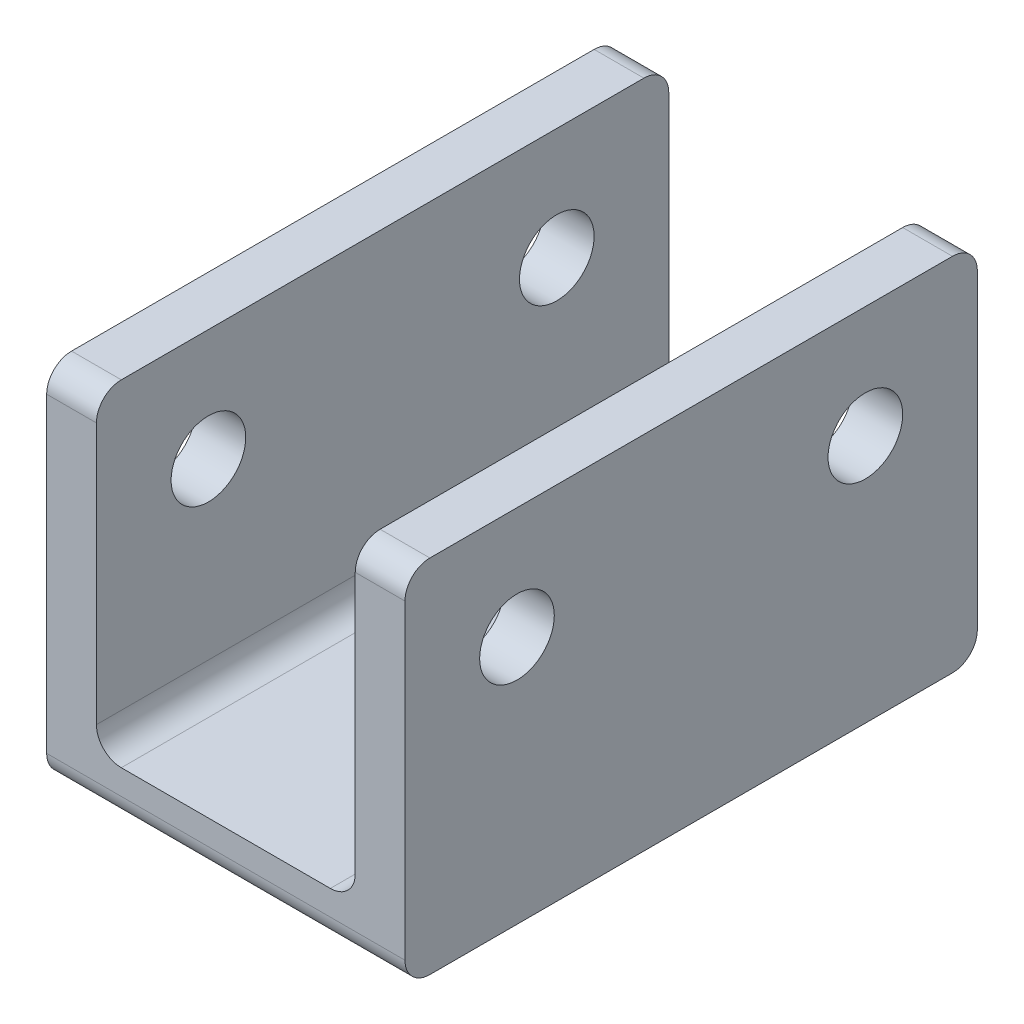
ISO-10303-21;
HEADER;
FILE_DESCRIPTION(('STEP AP214'),'2;1');
FILE_NAME('part.step','',(''),(''),'','','');
FILE_SCHEMA(('AUTOMOTIVE_DESIGN { 1 0 10303 214 1 1 1 1 }'));
ENDSEC;
DATA;
#1=APPLICATION_CONTEXT('core data for automotive mechanical design processes');
#2=APPLICATION_PROTOCOL_DEFINITION('international standard','automotive_design',2000,#1);
#3=PRODUCT_CONTEXT('',#1,'mechanical');
#4=PRODUCT('Part','Part','',(#3));
#5=PRODUCT_RELATED_PRODUCT_CATEGORY('part','',(#4));
#6=PRODUCT_DEFINITION_FORMATION('','',#4);
#7=PRODUCT_DEFINITION_CONTEXT('part definition',#1,'design');
#8=PRODUCT_DEFINITION('design','',#6,#7);
#9=PRODUCT_DEFINITION_SHAPE('','',#8);
#10=(LENGTH_UNIT() NAMED_UNIT(*) SI_UNIT(.MILLI.,.METRE.));
#11=(NAMED_UNIT(*) PLANE_ANGLE_UNIT() SI_UNIT($,.RADIAN.));
#12=(NAMED_UNIT(*) SI_UNIT($,.STERADIAN.) SOLID_ANGLE_UNIT());
#13=UNCERTAINTY_MEASURE_WITH_UNIT(LENGTH_MEASURE(1.E-05),#10,'distance_accuracy_value','');
#14=(GEOMETRIC_REPRESENTATION_CONTEXT(3) GLOBAL_UNCERTAINTY_ASSIGNED_CONTEXT((#13)) GLOBAL_UNIT_ASSIGNED_CONTEXT((#10,
#11,#12)) REPRESENTATION_CONTEXT('',''));
#15=CARTESIAN_POINT('',(0.,0.,0.));
#16=DIRECTION('',(0.,0.,1.));
#17=DIRECTION('',(1.,0.,0.));
#18=AXIS2_PLACEMENT_3D('',#15,#16,#17);
#19=CARTESIAN_POINT('',(-5.2,1.,11.5));
#20=DIRECTION('',(-1.,0.,0.));
#21=DIRECTION('',(0.,-1.,0.));
#22=AXIS2_PLACEMENT_3D('',#19,#20,#21);
#23=PLANE('',#22);
#24=CARTESIAN_POINT('',(-5.2,9.,7.));
#25=DIRECTION('',(-1.,0.,0.));
#26=DIRECTION('',(0.,-1.,0.));
#27=AXIS2_PLACEMENT_3D('',#24,#25,#26);
#28=CIRCLE('',#27,1.5);
#29=CARTESIAN_POINT('',(-5.2,7.5,7.));
#30=VERTEX_POINT('',#29);
#31=EDGE_CURVE('E304',#30,#30,#28,.T.);
#32=ORIENTED_EDGE('',*,*,#31,.T.);
#33=EDGE_LOOP('',(#32));
#34=FACE_BOUND('',#33,.T.);
#35=CARTESIAN_POINT('',(-5.2,9.,-7.));
#36=DIRECTION('',(-1.,0.,0.));
#37=DIRECTION('',(0.,-1.,0.));
#38=AXIS2_PLACEMENT_3D('',#35,#36,#37);
#39=CIRCLE('',#38,1.5);
#40=CARTESIAN_POINT('',(-5.2,7.5,-7.));
#41=VERTEX_POINT('',#40);
#42=EDGE_CURVE('E341',#41,#41,#39,.T.);
#43=ORIENTED_EDGE('',*,*,#42,.T.);
#44=EDGE_LOOP('',(#43));
#45=FACE_BOUND('',#44,.T.);
#46=DIRECTION('',(0.,1.,0.));
#47=VECTOR('',#46,1.);
#48=CARTESIAN_POINT('',(-5.2,1.,-11.5));
#49=LINE('',#48,#47);
#50=CARTESIAN_POINT('',(-5.2,2.,-11.5));
#51=VERTEX_POINT('',#50);
#52=CARTESIAN_POINT('',(-5.2,12.5,-11.5));
#53=VERTEX_POINT('',#52);
#54=EDGE_CURVE('E299',#51,#53,#49,.T.);
#55=ORIENTED_EDGE('',*,*,#54,.T.);
#56=CARTESIAN_POINT('',(-5.2,12.5,-10.5));
#57=DIRECTION('',(-1.,0.,0.));
#58=DIRECTION('',(0.,-1.,0.));
#59=AXIS2_PLACEMENT_3D('',#56,#57,#58);
#60=CIRCLE('',#59,1.);
#61=CARTESIAN_POINT('',(-5.2,13.5,-10.5));
#62=VERTEX_POINT('',#61);
#63=EDGE_CURVE('E261',#53,#62,#60,.F.);
#64=ORIENTED_EDGE('',*,*,#63,.T.);
#65=DIRECTION('',(0.,0.,-1.));
#66=VECTOR('',#65,1.);
#67=CARTESIAN_POINT('',(-5.2,13.5,11.5));
#68=LINE('',#67,#66);
#69=CARTESIAN_POINT('',(-5.2,13.5,10.5));
#70=VERTEX_POINT('',#69);
#71=EDGE_CURVE('E185',#70,#62,#68,.T.);
#72=ORIENTED_EDGE('',*,*,#71,.F.);
#73=CARTESIAN_POINT('',(-5.2,12.5,10.5));
#74=DIRECTION('',(-1.,0.,0.));
#75=DIRECTION('',(0.,-1.,0.));
#76=AXIS2_PLACEMENT_3D('',#73,#74,#75);
#77=CIRCLE('',#76,1.);
#78=CARTESIAN_POINT('',(-5.2,12.5,11.5));
#79=VERTEX_POINT('',#78);
#80=EDGE_CURVE('E258',#70,#79,#77,.F.);
#81=ORIENTED_EDGE('',*,*,#80,.T.);
#82=DIRECTION('',(0.,1.,0.));
#83=VECTOR('',#82,1.);
#84=CARTESIAN_POINT('',(-5.2,1.,11.5));
#85=LINE('',#84,#83);
#86=CARTESIAN_POINT('',(-5.2,2.,11.5));
#87=VERTEX_POINT('',#86);
#88=EDGE_CURVE('E166',#87,#79,#85,.T.);
#89=ORIENTED_EDGE('',*,*,#88,.F.);
#90=DIRECTION('',(0.,0.,-1.));
#91=VECTOR('',#90,1.);
#92=CARTESIAN_POINT('',(-5.2,2.,-11.5));
#93=LINE('',#92,#91);
#94=EDGE_CURVE('E211',#87,#51,#93,.T.);
#95=ORIENTED_EDGE('',*,*,#94,.T.);
#96=EDGE_LOOP('',(#55,#64,#72,#81,#89,#95));
#97=FACE_BOUND('',#96,.T.);
#98=ADVANCED_FACE('F39',(#34,#45,#97),#23,.F.);
#99=CARTESIAN_POINT('',(-5.2,13.5,11.5));
#100=DIRECTION('',(0.,-1.,0.));
#101=DIRECTION('',(0.,0.,-1.));
#102=AXIS2_PLACEMENT_3D('',#99,#100,#101);
#103=PLANE('',#102);
#104=ORIENTED_EDGE('',*,*,#71,.T.);
#105=DIRECTION('',(-1.,0.,0.));
#106=VECTOR('',#105,1.);
#107=CARTESIAN_POINT('',(-5.2,13.5,-10.5));
#108=LINE('',#107,#106);
#109=CARTESIAN_POINT('',(-7.2,13.5,-10.5));
#110=VERTEX_POINT('',#109);
#111=EDGE_CURVE('E242',#62,#110,#108,.T.);
#112=ORIENTED_EDGE('',*,*,#111,.T.);
#113=DIRECTION('',(0.,0.,-1.));
#114=VECTOR('',#113,1.);
#115=CARTESIAN_POINT('',(-7.2,13.5,11.5));
#116=LINE('',#115,#114);
#117=CARTESIAN_POINT('',(-7.2,13.5,10.5));
#118=VERTEX_POINT('',#117);
#119=EDGE_CURVE('E191',#118,#110,#116,.T.);
#120=ORIENTED_EDGE('',*,*,#119,.F.);
#121=DIRECTION('',(-1.,0.,0.));
#122=VECTOR('',#121,1.);
#123=CARTESIAN_POINT('',(-5.2,13.5,10.5));
#124=LINE('',#123,#122);
#125=EDGE_CURVE('E239',#118,#70,#124,.F.);
#126=ORIENTED_EDGE('',*,*,#125,.T.);
#127=EDGE_LOOP('',(#104,#112,#120,#126));
#128=FACE_BOUND('',#127,.T.);
#129=ADVANCED_FACE('F373',(#128),#103,.F.);
#130=CARTESIAN_POINT('',(-7.2,13.5,11.5));
#131=DIRECTION('',(1.,0.,0.));
#132=DIRECTION('',(0.,1.,0.));
#133=AXIS2_PLACEMENT_3D('',#130,#131,#132);
#134=PLANE('',#133);
#135=CARTESIAN_POINT('',(-7.2,9.,7.));
#136=DIRECTION('',(1.,0.,0.));
#137=DIRECTION('',(0.,1.,0.));
#138=AXIS2_PLACEMENT_3D('',#135,#136,#137);
#139=CIRCLE('',#138,1.5);
#140=CARTESIAN_POINT('',(-7.2,10.5,7.));
#141=VERTEX_POINT('',#140);
#142=EDGE_CURVE('E335',#141,#141,#139,.T.);
#143=ORIENTED_EDGE('',*,*,#142,.T.);
#144=EDGE_LOOP('',(#143));
#145=FACE_BOUND('',#144,.T.);
#146=CARTESIAN_POINT('',(-7.2,9.,-7.));
#147=DIRECTION('',(1.,0.,0.));
#148=DIRECTION('',(0.,-1.,0.));
#149=AXIS2_PLACEMENT_3D('',#146,#147,#148);
#150=CIRCLE('',#149,1.5);
#151=CARTESIAN_POINT('',(-7.2,7.5,-7.));
#152=VERTEX_POINT('',#151);
#153=EDGE_CURVE('E344',#152,#152,#150,.T.);
#154=ORIENTED_EDGE('',*,*,#153,.T.);
#155=EDGE_LOOP('',(#154));
#156=FACE_BOUND('',#155,.T.);
#157=ORIENTED_EDGE('',*,*,#119,.T.);
#158=CARTESIAN_POINT('',(-7.2,12.5,-10.5));
#159=DIRECTION('',(1.,0.,0.));
#160=DIRECTION('',(0.,1.,0.));
#161=AXIS2_PLACEMENT_3D('',#158,#159,#160);
#162=CIRCLE('',#161,1.);
#163=CARTESIAN_POINT('',(-7.2,12.5,-11.5));
#164=VERTEX_POINT('',#163);
#165=EDGE_CURVE('E249',#110,#164,#162,.F.);
#166=ORIENTED_EDGE('',*,*,#165,.T.);
#167=DIRECTION('',(0.,-1.,0.));
#168=VECTOR('',#167,1.);
#169=CARTESIAN_POINT('',(-7.2,13.5,-11.5));
#170=LINE('',#169,#168);
#171=CARTESIAN_POINT('',(-7.2,0.,-11.5));
#172=VERTEX_POINT('',#171);
#173=EDGE_CURVE('E303',#164,#172,#170,.T.);
#174=ORIENTED_EDGE('',*,*,#173,.T.);
#175=CARTESIAN_POINT('',(-7.2,0.,-10.5));
#176=DIRECTION('',(1.,0.,0.));
#177=DIRECTION('',(0.,1.,0.));
#178=AXIS2_PLACEMENT_3D('',#175,#176,#177);
#179=CIRCLE('',#178,1.);
#180=CARTESIAN_POINT('',(-7.2,-1.,-10.5));
#181=VERTEX_POINT('',#180);
#182=EDGE_CURVE('E179',#172,#181,#179,.F.);
#183=ORIENTED_EDGE('',*,*,#182,.T.);
#184=DIRECTION('',(0.,0.,-1.));
#185=VECTOR('',#184,1.);
#186=CARTESIAN_POINT('',(-7.2,-1.,11.5));
#187=LINE('',#186,#185);
#188=CARTESIAN_POINT('',(-7.2,-1.,10.5));
#189=VERTEX_POINT('',#188);
#190=EDGE_CURVE('E174',#189,#181,#187,.T.);
#191=ORIENTED_EDGE('',*,*,#190,.F.);
#192=CARTESIAN_POINT('',(-7.2,0.,10.5));
#193=DIRECTION('',(1.,0.,0.));
#194=DIRECTION('',(0.,1.,0.));
#195=AXIS2_PLACEMENT_3D('',#192,#193,#194);
#196=CIRCLE('',#195,1.);
#197=CARTESIAN_POINT('',(-7.2,0.,11.5));
#198=VERTEX_POINT('',#197);
#199=EDGE_CURVE('E170',#189,#198,#196,.F.);
#200=ORIENTED_EDGE('',*,*,#199,.T.);
#201=DIRECTION('',(0.,-1.,0.));
#202=VECTOR('',#201,1.);
#203=CARTESIAN_POINT('',(-7.2,13.5,11.5));
#204=LINE('',#203,#202);
#205=CARTESIAN_POINT('',(-7.2,12.5,11.5));
#206=VERTEX_POINT('',#205);
#207=EDGE_CURVE('E156',#206,#198,#204,.T.);
#208=ORIENTED_EDGE('',*,*,#207,.F.);
#209=CARTESIAN_POINT('',(-7.2,12.5,10.5));
#210=DIRECTION('',(1.,0.,0.));
#211=DIRECTION('',(0.,1.,0.));
#212=AXIS2_PLACEMENT_3D('',#209,#210,#211);
#213=CIRCLE('',#212,1.);
#214=EDGE_CURVE('E246',#206,#118,#213,.F.);
#215=ORIENTED_EDGE('',*,*,#214,.T.);
#216=EDGE_LOOP('',(#157,#166,#174,#183,#191,#200,#208,#215));
#217=FACE_BOUND('',#216,.T.);
#218=ADVANCED_FACE('F172',(#145,#156,#217),#134,.F.);
#219=CARTESIAN_POINT('',(7.2,-1.,11.5));
#220=DIRECTION('',(0.,1.,0.));
#221=DIRECTION('',(0.,0.,1.));
#222=AXIS2_PLACEMENT_3D('',#219,#220,#221);
#223=PLANE('',#222);
#224=DIRECTION('',(0.,0.,-1.));
#225=VECTOR('',#224,1.);
#226=CARTESIAN_POINT('',(7.2,-1.,11.5));
#227=LINE('',#226,#225);
#228=CARTESIAN_POINT('',(7.2,-1.,10.5));
#229=VERTEX_POINT('',#228);
#230=CARTESIAN_POINT('',(7.2,-1.,-10.5));
#231=VERTEX_POINT('',#230);
#232=EDGE_CURVE('E324',#229,#231,#227,.T.);
#233=ORIENTED_EDGE('',*,*,#232,.F.);
#234=DIRECTION('',(1.,0.,0.));
#235=VECTOR('',#234,1.);
#236=CARTESIAN_POINT('',(-7.2,-1.,10.5));
#237=LINE('',#236,#235);
#238=EDGE_CURVE('E203',#229,#189,#237,.F.);
#239=ORIENTED_EDGE('',*,*,#238,.T.);
#240=ORIENTED_EDGE('',*,*,#190,.T.);
#241=DIRECTION('',(1.,0.,0.));
#242=VECTOR('',#241,1.);
#243=CARTESIAN_POINT('',(7.2,-1.,-10.5));
#244=LINE('',#243,#242);
#245=EDGE_CURVE('E199',#181,#231,#244,.T.);
#246=ORIENTED_EDGE('',*,*,#245,.T.);
#247=EDGE_LOOP('',(#233,#239,#240,#246));
#248=FACE_BOUND('',#247,.T.);
#249=ADVANCED_FACE('F392',(#248),#223,.F.);
#250=CARTESIAN_POINT('',(7.2,13.5,11.5));
#251=DIRECTION('',(-1.,0.,0.));
#252=DIRECTION('',(0.,-1.,0.));
#253=AXIS2_PLACEMENT_3D('',#250,#251,#252);
#254=PLANE('',#253);
#255=CARTESIAN_POINT('',(7.2,9.,7.));
#256=DIRECTION('',(-1.,0.,0.));
#257=DIRECTION('',(0.,-1.,0.));
#258=AXIS2_PLACEMENT_3D('',#255,#256,#257);
#259=CIRCLE('',#258,1.5);
#260=CARTESIAN_POINT('',(7.2,7.5,7.));
#261=VERTEX_POINT('',#260);
#262=EDGE_CURVE('E355',#261,#261,#259,.T.);
#263=ORIENTED_EDGE('',*,*,#262,.T.);
#264=EDGE_LOOP('',(#263));
#265=FACE_BOUND('',#264,.T.);
#266=CARTESIAN_POINT('',(7.2,9.,-7.));
#267=DIRECTION('',(-1.,0.,0.));
#268=DIRECTION('',(0.,-1.,0.));
#269=AXIS2_PLACEMENT_3D('',#266,#267,#268);
#270=CIRCLE('',#269,1.5);
#271=CARTESIAN_POINT('',(7.2,7.5,-7.));
#272=VERTEX_POINT('',#271);
#273=EDGE_CURVE('E334',#272,#272,#270,.T.);
#274=ORIENTED_EDGE('',*,*,#273,.T.);
#275=EDGE_LOOP('',(#274));
#276=FACE_BOUND('',#275,.T.);
#277=DIRECTION('',(0.,1.,0.));
#278=VECTOR('',#277,1.);
#279=CARTESIAN_POINT('',(7.2,13.5,-11.5));
#280=LINE('',#279,#278);
#281=CARTESIAN_POINT('',(7.2,0.,-11.5));
#282=VERTEX_POINT('',#281);
#283=CARTESIAN_POINT('',(7.2,12.5,-11.5));
#284=VERTEX_POINT('',#283);
#285=EDGE_CURVE('E307',#282,#284,#280,.T.);
#286=ORIENTED_EDGE('',*,*,#285,.T.);
#287=CARTESIAN_POINT('',(7.2,12.5,-10.5));
#288=DIRECTION('',(-1.,0.,0.));
#289=DIRECTION('',(0.,-1.,0.));
#290=AXIS2_PLACEMENT_3D('',#287,#288,#289);
#291=CIRCLE('',#290,1.);
#292=CARTESIAN_POINT('',(7.2,13.5,-10.5));
#293=VERTEX_POINT('',#292);
#294=EDGE_CURVE('E278',#284,#293,#291,.F.);
#295=ORIENTED_EDGE('',*,*,#294,.T.);
#296=DIRECTION('',(0.,0.,-1.));
#297=VECTOR('',#296,1.);
#298=CARTESIAN_POINT('',(7.2,13.5,11.5));
#299=LINE('',#298,#297);
#300=CARTESIAN_POINT('',(7.2,13.5,10.5));
#301=VERTEX_POINT('',#300);
#302=EDGE_CURVE('E320',#301,#293,#299,.T.);
#303=ORIENTED_EDGE('',*,*,#302,.F.);
#304=CARTESIAN_POINT('',(7.2,12.5,10.5));
#305=DIRECTION('',(-1.,0.,0.));
#306=DIRECTION('',(0.,-1.,0.));
#307=AXIS2_PLACEMENT_3D('',#304,#305,#306);
#308=CIRCLE('',#307,1.);
#309=CARTESIAN_POINT('',(7.2,12.5,11.5));
#310=VERTEX_POINT('',#309);
#311=EDGE_CURVE('E55',#301,#310,#308,.F.);
#312=ORIENTED_EDGE('',*,*,#311,.T.);
#313=DIRECTION('',(0.,1.,0.));
#314=VECTOR('',#313,1.);
#315=CARTESIAN_POINT('',(7.2,13.5,11.5));
#316=LINE('',#315,#314);
#317=CARTESIAN_POINT('',(7.2,0.,11.5));
#318=VERTEX_POINT('',#317);
#319=EDGE_CURVE('E165',#318,#310,#316,.T.);
#320=ORIENTED_EDGE('',*,*,#319,.F.);
#321=CARTESIAN_POINT('',(7.2,0.,10.5));
#322=DIRECTION('',(-1.,0.,0.));
#323=DIRECTION('',(0.,-1.,0.));
#324=AXIS2_PLACEMENT_3D('',#321,#322,#323);
#325=CIRCLE('',#324,1.);
#326=EDGE_CURVE('E182',#318,#229,#325,.F.);
#327=ORIENTED_EDGE('',*,*,#326,.T.);
#328=ORIENTED_EDGE('',*,*,#232,.T.);
#329=CARTESIAN_POINT('',(7.2,0.,-10.5));
#330=DIRECTION('',(-1.,0.,0.));
#331=DIRECTION('',(0.,-1.,0.));
#332=AXIS2_PLACEMENT_3D('',#329,#330,#331);
#333=CIRCLE('',#332,1.);
#334=EDGE_CURVE('E184',#231,#282,#333,.F.);
#335=ORIENTED_EDGE('',*,*,#334,.T.);
#336=EDGE_LOOP('',(#286,#295,#303,#312,#320,#327,#328,#335));
#337=FACE_BOUND('',#336,.T.);
#338=ADVANCED_FACE('F393',(#265,#276,#337),#254,.F.);
#339=CARTESIAN_POINT('',(5.2,13.5,11.5));
#340=DIRECTION('',(0.,-1.,0.));
#341=DIRECTION('',(0.,0.,-1.));
#342=AXIS2_PLACEMENT_3D('',#339,#340,#341);
#343=PLANE('',#342);
#344=ORIENTED_EDGE('',*,*,#302,.T.);
#345=DIRECTION('',(-1.,0.,0.));
#346=VECTOR('',#345,1.);
#347=CARTESIAN_POINT('',(5.2,13.5,-10.5));
#348=LINE('',#347,#346);
#349=CARTESIAN_POINT('',(5.2,13.5,-10.5));
#350=VERTEX_POINT('',#349);
#351=EDGE_CURVE('E267',#293,#350,#348,.T.);
#352=ORIENTED_EDGE('',*,*,#351,.T.);
#353=DIRECTION('',(0.,0.,-1.));
#354=VECTOR('',#353,1.);
#355=CARTESIAN_POINT('',(5.2,13.5,11.5));
#356=LINE('',#355,#354);
#357=CARTESIAN_POINT('',(5.2,13.5,10.5));
#358=VERTEX_POINT('',#357);
#359=EDGE_CURVE('E295',#358,#350,#356,.T.);
#360=ORIENTED_EDGE('',*,*,#359,.F.);
#361=DIRECTION('',(-1.,0.,0.));
#362=VECTOR('',#361,1.);
#363=CARTESIAN_POINT('',(7.2,13.5,10.5));
#364=LINE('',#363,#362);
#365=EDGE_CURVE('E264',#358,#301,#364,.F.);
#366=ORIENTED_EDGE('',*,*,#365,.T.);
#367=EDGE_LOOP('',(#344,#352,#360,#366));
#368=FACE_BOUND('',#367,.T.);
#369=ADVANCED_FACE('F400',(#368),#343,.F.);
#370=CARTESIAN_POINT('',(5.2,1.,11.5));
#371=DIRECTION('',(1.,0.,0.));
#372=DIRECTION('',(0.,1.,0.));
#373=AXIS2_PLACEMENT_3D('',#370,#371,#372);
#374=PLANE('',#373);
#375=CARTESIAN_POINT('',(5.2,9.,7.));
#376=DIRECTION('',(1.,0.,0.));
#377=DIRECTION('',(0.,1.,0.));
#378=AXIS2_PLACEMENT_3D('',#375,#376,#377);
#379=CIRCLE('',#378,1.5);
#380=CARTESIAN_POINT('',(5.2,10.5,7.));
#381=VERTEX_POINT('',#380);
#382=EDGE_CURVE('E194',#381,#381,#379,.T.);
#383=ORIENTED_EDGE('',*,*,#382,.T.);
#384=EDGE_LOOP('',(#383));
#385=FACE_BOUND('',#384,.T.);
#386=CARTESIAN_POINT('',(5.2,9.,-7.));
#387=DIRECTION('',(1.,0.,0.));
#388=DIRECTION('',(0.,1.,0.));
#389=AXIS2_PLACEMENT_3D('',#386,#387,#388);
#390=CIRCLE('',#389,1.5);
#391=CARTESIAN_POINT('',(5.2,10.5,-7.));
#392=VERTEX_POINT('',#391);
#393=EDGE_CURVE('E331',#392,#392,#390,.T.);
#394=ORIENTED_EDGE('',*,*,#393,.T.);
#395=EDGE_LOOP('',(#394));
#396=FACE_BOUND('',#395,.T.);
#397=ORIENTED_EDGE('',*,*,#359,.T.);
#398=CARTESIAN_POINT('',(5.2,12.5,-10.5));
#399=DIRECTION('',(1.,0.,0.));
#400=DIRECTION('',(0.,1.,0.));
#401=AXIS2_PLACEMENT_3D('',#398,#399,#400);
#402=CIRCLE('',#401,1.);
#403=CARTESIAN_POINT('',(5.2,12.5,-11.5));
#404=VERTEX_POINT('',#403);
#405=EDGE_CURVE('E273',#350,#404,#402,.F.);
#406=ORIENTED_EDGE('',*,*,#405,.T.);
#407=DIRECTION('',(0.,-1.,0.));
#408=VECTOR('',#407,1.);
#409=CARTESIAN_POINT('',(5.2,1.,-11.5));
#410=LINE('',#409,#408);
#411=CARTESIAN_POINT('',(5.2,2.,-11.5));
#412=VERTEX_POINT('',#411);
#413=EDGE_CURVE('E311',#404,#412,#410,.T.);
#414=ORIENTED_EDGE('',*,*,#413,.T.);
#415=DIRECTION('',(0.,0.,-1.));
#416=VECTOR('',#415,1.);
#417=CARTESIAN_POINT('',(5.2,2.,11.5));
#418=LINE('',#417,#416);
#419=CARTESIAN_POINT('',(5.2,2.,11.5));
#420=VERTEX_POINT('',#419);
#421=EDGE_CURVE('E222',#412,#420,#418,.F.);
#422=ORIENTED_EDGE('',*,*,#421,.T.);
#423=DIRECTION('',(0.,-1.,0.));
#424=VECTOR('',#423,1.);
#425=CARTESIAN_POINT('',(5.2,1.,11.5));
#426=LINE('',#425,#424);
#427=CARTESIAN_POINT('',(5.2,12.5,11.5));
#428=VERTEX_POINT('',#427);
#429=EDGE_CURVE('E282',#428,#420,#426,.T.);
#430=ORIENTED_EDGE('',*,*,#429,.F.);
#431=CARTESIAN_POINT('',(5.2,12.5,10.5));
#432=DIRECTION('',(1.,0.,0.));
#433=DIRECTION('',(0.,1.,0.));
#434=AXIS2_PLACEMENT_3D('',#431,#432,#433);
#435=CIRCLE('',#434,1.);
#436=EDGE_CURVE('E63',#428,#358,#435,.F.);
#437=ORIENTED_EDGE('',*,*,#436,.T.);
#438=EDGE_LOOP('',(#397,#406,#414,#422,#430,#437));
#439=FACE_BOUND('',#438,.T.);
#440=ADVANCED_FACE('F285',(#385,#396,#439),#374,.F.);
#441=CARTESIAN_POINT('',(-5.2,1.,11.5));
#442=DIRECTION('',(0.,-1.,0.));
#443=DIRECTION('',(0.,0.,-1.));
#444=AXIS2_PLACEMENT_3D('',#441,#442,#443);
#445=PLANE('',#444);
#446=DIRECTION('',(-1.,0.,0.));
#447=VECTOR('',#446,1.);
#448=CARTESIAN_POINT('',(-5.2,1.,-11.5));
#449=LINE('',#448,#447);
#450=CARTESIAN_POINT('',(4.2,1.,-11.5));
#451=VERTEX_POINT('',#450);
#452=CARTESIAN_POINT('',(-4.2,1.,-11.5));
#453=VERTEX_POINT('',#452);
#454=EDGE_CURVE('E314',#451,#453,#449,.T.);
#455=ORIENTED_EDGE('',*,*,#454,.T.);
#456=DIRECTION('',(0.,0.,-1.));
#457=VECTOR('',#456,1.);
#458=CARTESIAN_POINT('',(-4.2,1.,11.5));
#459=LINE('',#458,#457);
#460=CARTESIAN_POINT('',(-4.2,1.,11.5));
#461=VERTEX_POINT('',#460);
#462=EDGE_CURVE('E219',#453,#461,#459,.F.);
#463=ORIENTED_EDGE('',*,*,#462,.T.);
#464=DIRECTION('',(-1.,0.,0.));
#465=VECTOR('',#464,1.);
#466=CARTESIAN_POINT('',(-5.2,1.,11.5));
#467=LINE('',#466,#465);
#468=CARTESIAN_POINT('',(4.2,1.,11.5));
#469=VERTEX_POINT('',#468);
#470=EDGE_CURVE('E290',#469,#461,#467,.T.);
#471=ORIENTED_EDGE('',*,*,#470,.F.);
#472=DIRECTION('',(0.,0.,-1.));
#473=VECTOR('',#472,1.);
#474=CARTESIAN_POINT('',(4.2,1.,-11.5));
#475=LINE('',#474,#473);
#476=EDGE_CURVE('E215',#469,#451,#475,.T.);
#477=ORIENTED_EDGE('',*,*,#476,.T.);
#478=EDGE_LOOP('',(#455,#463,#471,#477));
#479=FACE_BOUND('',#478,.T.);
#480=ADVANCED_FACE('F408',(#479),#445,.F.);
#481=CARTESIAN_POINT('',(0.,0.,11.5));
#482=DIRECTION('',(0.,0.,1.));
#483=DIRECTION('',(1.,0.,0.));
#484=AXIS2_PLACEMENT_3D('',#481,#482,#483);
#485=PLANE('',#484);
#486=ORIENTED_EDGE('',*,*,#88,.T.);
#487=DIRECTION('',(-1.,0.,0.));
#488=VECTOR('',#487,1.);
#489=CARTESIAN_POINT('',(-7.2,12.5,11.5));
#490=LINE('',#489,#488);
#491=EDGE_CURVE('E11',#79,#206,#490,.T.);
#492=ORIENTED_EDGE('',*,*,#491,.T.);
#493=ORIENTED_EDGE('',*,*,#207,.T.);
#494=DIRECTION('',(1.,0.,0.));
#495=VECTOR('',#494,1.);
#496=CARTESIAN_POINT('',(7.2,0.,11.5));
#497=LINE('',#496,#495);
#498=EDGE_CURVE('E161',#198,#318,#497,.T.);
#499=ORIENTED_EDGE('',*,*,#498,.T.);
#500=ORIENTED_EDGE('',*,*,#319,.T.);
#501=DIRECTION('',(-1.,0.,0.));
#502=VECTOR('',#501,1.);
#503=CARTESIAN_POINT('',(5.2,12.5,11.5));
#504=LINE('',#503,#502);
#505=EDGE_CURVE('E48',#310,#428,#504,.T.);
#506=ORIENTED_EDGE('',*,*,#505,.T.);
#507=ORIENTED_EDGE('',*,*,#429,.T.);
#508=CARTESIAN_POINT('',(4.2,2.,11.5));
#509=DIRECTION('',(0.,0.,1.));
#510=DIRECTION('',(1.,0.,0.));
#511=AXIS2_PLACEMENT_3D('',#508,#509,#510);
#512=CIRCLE('',#511,1.);
#513=EDGE_CURVE('E236',#420,#469,#512,.F.);
#514=ORIENTED_EDGE('',*,*,#513,.T.);
#515=ORIENTED_EDGE('',*,*,#470,.T.);
#516=CARTESIAN_POINT('',(-4.2,2.,11.5));
#517=DIRECTION('',(0.,0.,1.));
#518=DIRECTION('',(1.,0.,0.));
#519=AXIS2_PLACEMENT_3D('',#516,#517,#518);
#520=CIRCLE('',#519,1.);
#521=EDGE_CURVE('E229',#461,#87,#520,.F.);
#522=ORIENTED_EDGE('',*,*,#521,.T.);
#523=EDGE_LOOP('',(#486,#492,#493,#499,#500,#506,#507,#514,#515,#522));
#524=FACE_BOUND('',#523,.T.);
#525=ADVANCED_FACE('F159',(#524),#485,.T.);
#526=CARTESIAN_POINT('',(0.,0.,-11.5));
#527=DIRECTION('',(0.,0.,1.));
#528=DIRECTION('',(1.,0.,0.));
#529=AXIS2_PLACEMENT_3D('',#526,#527,#528);
#530=PLANE('',#529);
#531=ORIENTED_EDGE('',*,*,#173,.F.);
#532=DIRECTION('',(-1.,0.,0.));
#533=VECTOR('',#532,1.);
#534=CARTESIAN_POINT('',(0.,12.5,-11.5));
#535=LINE('',#534,#533);
#536=EDGE_CURVE('E255',#164,#53,#535,.F.);
#537=ORIENTED_EDGE('',*,*,#536,.T.);
#538=ORIENTED_EDGE('',*,*,#54,.F.);
#539=CARTESIAN_POINT('',(-4.2,2.,-11.5));
#540=DIRECTION('',(0.,0.,1.));
#541=DIRECTION('',(1.,0.,0.));
#542=AXIS2_PLACEMENT_3D('',#539,#540,#541);
#543=CIRCLE('',#542,1.);
#544=EDGE_CURVE('E226',#51,#453,#543,.T.);
#545=ORIENTED_EDGE('',*,*,#544,.T.);
#546=ORIENTED_EDGE('',*,*,#454,.F.);
#547=CARTESIAN_POINT('',(4.2,2.,-11.5));
#548=DIRECTION('',(0.,0.,1.));
#549=DIRECTION('',(1.,0.,0.));
#550=AXIS2_PLACEMENT_3D('',#547,#548,#549);
#551=CIRCLE('',#550,1.);
#552=EDGE_CURVE('E232',#451,#412,#551,.T.);
#553=ORIENTED_EDGE('',*,*,#552,.T.);
#554=ORIENTED_EDGE('',*,*,#413,.F.);
#555=DIRECTION('',(-1.,0.,0.));
#556=VECTOR('',#555,1.);
#557=CARTESIAN_POINT('',(0.,12.5,-11.5));
#558=LINE('',#557,#556);
#559=EDGE_CURVE('E252',#404,#284,#558,.F.);
#560=ORIENTED_EDGE('',*,*,#559,.T.);
#561=ORIENTED_EDGE('',*,*,#285,.F.);
#562=DIRECTION('',(1.,0.,0.));
#563=VECTOR('',#562,1.);
#564=CARTESIAN_POINT('',(0.,0.,-11.5));
#565=LINE('',#564,#563);
#566=EDGE_CURVE('E178',#282,#172,#565,.F.);
#567=ORIENTED_EDGE('',*,*,#566,.T.);
#568=EDGE_LOOP('',(#531,#537,#538,#545,#546,#553,#554,#560,#561,#567));
#569=FACE_BOUND('',#568,.T.);
#570=ADVANCED_FACE('F382',(#569),#530,.F.);
#571=CARTESIAN_POINT('',(-7.2,9.,-7.));
#572=DIRECTION('',(1.,0.,0.));
#573=DIRECTION('',(0.,1.,0.));
#574=AXIS2_PLACEMENT_3D('',#571,#572,#573);
#575=CYLINDRICAL_SURFACE('',#574,1.5);
#576=ORIENTED_EDGE('',*,*,#393,.F.);
#577=EDGE_LOOP('',(#576));
#578=FACE_BOUND('',#577,.T.);
#579=ORIENTED_EDGE('',*,*,#273,.F.);
#580=EDGE_LOOP('',(#579));
#581=FACE_BOUND('',#580,.T.);
#582=ADVANCED_FACE('F466',(#578,#581),#575,.F.);
#583=CARTESIAN_POINT('',(-7.2,9.,7.));
#584=DIRECTION('',(1.,0.,0.));
#585=DIRECTION('',(0.,1.,0.));
#586=AXIS2_PLACEMENT_3D('',#583,#584,#585);
#587=CYLINDRICAL_SURFACE('',#586,1.5);
#588=ORIENTED_EDGE('',*,*,#382,.F.);
#589=EDGE_LOOP('',(#588));
#590=FACE_BOUND('',#589,.T.);
#591=ORIENTED_EDGE('',*,*,#262,.F.);
#592=EDGE_LOOP('',(#591));
#593=FACE_BOUND('',#592,.T.);
#594=ADVANCED_FACE('F546',(#590,#593),#587,.F.);
#595=ORIENTED_EDGE('',*,*,#153,.F.);
#596=EDGE_LOOP('',(#595));
#597=FACE_BOUND('',#596,.T.);
#598=ORIENTED_EDGE('',*,*,#42,.F.);
#599=EDGE_LOOP('',(#598));
#600=FACE_BOUND('',#599,.T.);
#601=ADVANCED_FACE('F549',(#597,#600),#575,.F.);
#602=ORIENTED_EDGE('',*,*,#142,.F.);
#603=EDGE_LOOP('',(#602));
#604=FACE_BOUND('',#603,.T.);
#605=ORIENTED_EDGE('',*,*,#31,.F.);
#606=EDGE_LOOP('',(#605));
#607=FACE_BOUND('',#606,.T.);
#608=ADVANCED_FACE('F425',(#604,#607),#587,.F.);
#609=CARTESIAN_POINT('',(0.,0.,10.5));
#610=DIRECTION('',(-1.,0.,0.));
#611=DIRECTION('',(0.,0.,1.));
#612=AXIS2_PLACEMENT_3D('',#609,#610,#611);
#613=CYLINDRICAL_SURFACE('',#612,1.);
#614=ORIENTED_EDGE('',*,*,#199,.F.);
#615=ORIENTED_EDGE('',*,*,#238,.F.);
#616=ORIENTED_EDGE('',*,*,#326,.F.);
#617=ORIENTED_EDGE('',*,*,#498,.F.);
#618=EDGE_LOOP('',(#614,#615,#616,#617));
#619=FACE_BOUND('',#618,.T.);
#620=ADVANCED_FACE('F181',(#619),#613,.T.);
#621=CARTESIAN_POINT('',(7.2,0.,-10.5));
#622=DIRECTION('',(1.,0.,0.));
#623=DIRECTION('',(0.,0.,-1.));
#624=AXIS2_PLACEMENT_3D('',#621,#622,#623);
#625=CYLINDRICAL_SURFACE('',#624,1.);
#626=ORIENTED_EDGE('',*,*,#182,.F.);
#627=ORIENTED_EDGE('',*,*,#566,.F.);
#628=ORIENTED_EDGE('',*,*,#334,.F.);
#629=ORIENTED_EDGE('',*,*,#245,.F.);
#630=EDGE_LOOP('',(#626,#627,#628,#629));
#631=FACE_BOUND('',#630,.T.);
#632=ADVANCED_FACE('F389',(#631),#625,.T.);
#633=CARTESIAN_POINT('',(-4.2,2.,11.5));
#634=DIRECTION('',(0.,0.,1.));
#635=DIRECTION('',(1.,0.,0.));
#636=AXIS2_PLACEMENT_3D('',#633,#634,#635);
#637=CYLINDRICAL_SURFACE('',#636,1.);
#638=ORIENTED_EDGE('',*,*,#521,.F.);
#639=ORIENTED_EDGE('',*,*,#462,.F.);
#640=ORIENTED_EDGE('',*,*,#544,.F.);
#641=ORIENTED_EDGE('',*,*,#94,.F.);
#642=EDGE_LOOP('',(#638,#639,#640,#641));
#643=FACE_BOUND('',#642,.T.);
#644=ADVANCED_FACE('F411',(#643),#637,.F.);
#645=CARTESIAN_POINT('',(4.2,2.,11.5));
#646=DIRECTION('',(0.,0.,1.));
#647=DIRECTION('',(1.,0.,0.));
#648=AXIS2_PLACEMENT_3D('',#645,#646,#647);
#649=CYLINDRICAL_SURFACE('',#648,1.);
#650=ORIENTED_EDGE('',*,*,#513,.F.);
#651=ORIENTED_EDGE('',*,*,#421,.F.);
#652=ORIENTED_EDGE('',*,*,#552,.F.);
#653=ORIENTED_EDGE('',*,*,#476,.F.);
#654=EDGE_LOOP('',(#650,#651,#652,#653));
#655=FACE_BOUND('',#654,.T.);
#656=ADVANCED_FACE('F405',(#655),#649,.F.);
#657=CARTESIAN_POINT('',(-5.2,12.5,-10.5));
#658=DIRECTION('',(-1.,0.,0.));
#659=DIRECTION('',(0.,0.,1.));
#660=AXIS2_PLACEMENT_3D('',#657,#658,#659);
#661=CYLINDRICAL_SURFACE('',#660,1.);
#662=ORIENTED_EDGE('',*,*,#63,.F.);
#663=ORIENTED_EDGE('',*,*,#536,.F.);
#664=ORIENTED_EDGE('',*,*,#165,.F.);
#665=ORIENTED_EDGE('',*,*,#111,.F.);
#666=EDGE_LOOP('',(#662,#663,#664,#665));
#667=FACE_BOUND('',#666,.T.);
#668=ADVANCED_FACE('F378',(#667),#661,.T.);
#669=CARTESIAN_POINT('',(5.2,12.5,-10.5));
#670=DIRECTION('',(-1.,0.,0.));
#671=DIRECTION('',(0.,0.,1.));
#672=AXIS2_PLACEMENT_3D('',#669,#670,#671);
#673=CYLINDRICAL_SURFACE('',#672,1.);
#674=ORIENTED_EDGE('',*,*,#294,.F.);
#675=ORIENTED_EDGE('',*,*,#559,.F.);
#676=ORIENTED_EDGE('',*,*,#405,.F.);
#677=ORIENTED_EDGE('',*,*,#351,.F.);
#678=EDGE_LOOP('',(#674,#675,#676,#677));
#679=FACE_BOUND('',#678,.T.);
#680=ADVANCED_FACE('F398',(#679),#673,.T.);
#681=CARTESIAN_POINT('',(0.,12.5,10.5));
#682=DIRECTION('',(1.,0.,0.));
#683=DIRECTION('',(0.,0.,-1.));
#684=AXIS2_PLACEMENT_3D('',#681,#682,#683);
#685=CYLINDRICAL_SURFACE('',#684,1.);
#686=ORIENTED_EDGE('',*,*,#80,.F.);
#687=ORIENTED_EDGE('',*,*,#125,.F.);
#688=ORIENTED_EDGE('',*,*,#214,.F.);
#689=ORIENTED_EDGE('',*,*,#491,.F.);
#690=EDGE_LOOP('',(#686,#687,#688,#689));
#691=FACE_BOUND('',#690,.T.);
#692=ADVANCED_FACE('F369',(#691),#685,.T.);
#693=CARTESIAN_POINT('',(0.,12.5,10.5));
#694=DIRECTION('',(1.,0.,0.));
#695=DIRECTION('',(0.,0.,-1.));
#696=AXIS2_PLACEMENT_3D('',#693,#694,#695);
#697=CYLINDRICAL_SURFACE('',#696,1.);
#698=ORIENTED_EDGE('',*,*,#311,.F.);
#699=ORIENTED_EDGE('',*,*,#365,.F.);
#700=ORIENTED_EDGE('',*,*,#436,.F.);
#701=ORIENTED_EDGE('',*,*,#505,.F.);
#702=EDGE_LOOP('',(#698,#699,#700,#701));
#703=FACE_BOUND('',#702,.T.);
#704=ADVANCED_FACE('F41',(#703),#697,.T.);
#705=CLOSED_SHELL('',(#98,#129,#218,#249,#338,#369,#440,#480,#525,#570,#582,#594,#601,#608,#620,
#632,#644,#656,#668,#680,#692,#704));
#706=MANIFOLD_SOLID_BREP('B2',#705);
#707=ADVANCED_BREP_SHAPE_REPRESENTATION('',(#18,#706),#14);
#708=SHAPE_DEFINITION_REPRESENTATION(#9,#707);
ENDSEC;
END-ISO-10303-21;
